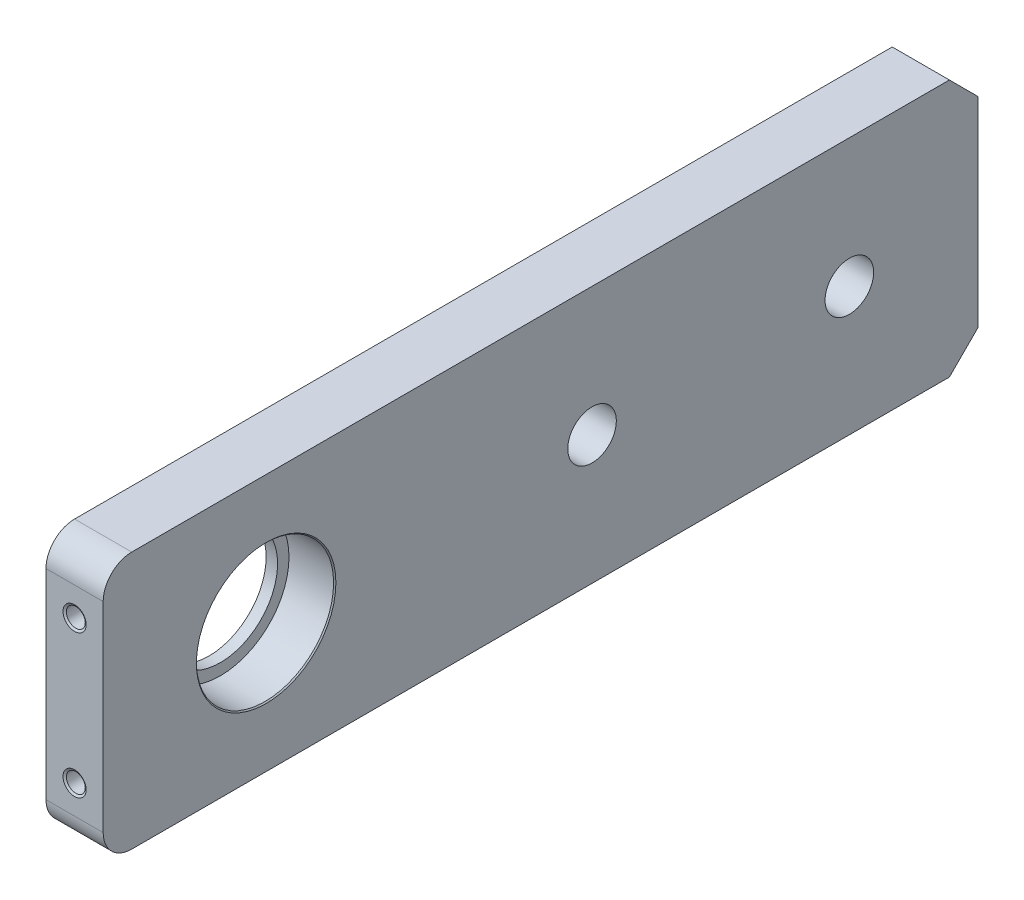
ISO-10303-21;
HEADER;
FILE_DESCRIPTION(('STEP AP214'),'2;1');
FILE_NAME('part.step','',(''),(''),'','','');
FILE_SCHEMA(('AUTOMOTIVE_DESIGN { 1 0 10303 214 1 1 1 1 }'));
ENDSEC;
DATA;
#1=APPLICATION_CONTEXT('core data for automotive mechanical design processes');
#2=APPLICATION_PROTOCOL_DEFINITION('international standard','automotive_design',2000,#1);
#3=PRODUCT_CONTEXT('',#1,'mechanical');
#4=PRODUCT('Part','Part','',(#3));
#5=PRODUCT_RELATED_PRODUCT_CATEGORY('part','',(#4));
#6=PRODUCT_DEFINITION_FORMATION('','',#4);
#7=PRODUCT_DEFINITION_CONTEXT('part definition',#1,'design');
#8=PRODUCT_DEFINITION('design','',#6,#7);
#9=PRODUCT_DEFINITION_SHAPE('','',#8);
#10=(LENGTH_UNIT() NAMED_UNIT(*) SI_UNIT(.MILLI.,.METRE.));
#11=(NAMED_UNIT(*) PLANE_ANGLE_UNIT() SI_UNIT($,.RADIAN.));
#12=(NAMED_UNIT(*) SI_UNIT($,.STERADIAN.) SOLID_ANGLE_UNIT());
#13=UNCERTAINTY_MEASURE_WITH_UNIT(LENGTH_MEASURE(1.E-05),#10,'distance_accuracy_value','');
#14=(GEOMETRIC_REPRESENTATION_CONTEXT(3) GLOBAL_UNCERTAINTY_ASSIGNED_CONTEXT((#13)) GLOBAL_UNIT_ASSIGNED_CONTEXT((#10,
#11,#12)) REPRESENTATION_CONTEXT('',''));
#15=CARTESIAN_POINT('',(0.,0.,0.));
#16=DIRECTION('',(0.,0.,1.));
#17=DIRECTION('',(1.,0.,0.));
#18=AXIS2_PLACEMENT_3D('',#15,#16,#17);
#19=CARTESIAN_POINT('',(5.,0.,0.));
#20=DIRECTION('',(1.,0.,0.));
#21=DIRECTION('',(0.,0.,-1.));
#22=AXIS2_PLACEMENT_3D('',#19,#20,#21);
#23=PLANE('',#22);
#24=CARTESIAN_POINT('',(5.,-22.5,-28.5));
#25=DIRECTION('',(1.,0.,0.));
#26=DIRECTION('',(0.,0.,-1.));
#27=AXIS2_PLACEMENT_3D('',#24,#25,#26);
#28=CIRCLE('',#27,12.2);
#29=CARTESIAN_POINT('',(5.,-22.5,-40.7));
#30=VERTEX_POINT('',#29);
#31=EDGE_CURVE('E75',#30,#30,#28,.F.);
#32=ORIENTED_EDGE('',*,*,#31,.T.);
#33=EDGE_LOOP('',(#32));
#34=FACE_BOUND('',#33,.T.);
#35=CARTESIAN_POINT('',(5.,-22.5,-85.5));
#36=DIRECTION('',(1.,0.,0.));
#37=DIRECTION('',(0.,0.,-1.));
#38=AXIS2_PLACEMENT_3D('',#35,#36,#37);
#39=CIRCLE('',#38,4.25);
#40=CARTESIAN_POINT('',(5.,-22.5,-89.75));
#41=VERTEX_POINT('',#40);
#42=EDGE_CURVE('E271',#41,#41,#39,.T.);
#43=ORIENTED_EDGE('',*,*,#42,.F.);
#44=EDGE_LOOP('',(#43));
#45=FACE_BOUND('',#44,.T.);
#46=DIRECTION('',(0.,0.,1.));
#47=VECTOR('',#46,1.);
#48=CARTESIAN_POINT('',(5.,0.,0.));
#49=LINE('',#48,#47);
#50=CARTESIAN_POINT('',(5.,0.,-148.));
#51=VERTEX_POINT('',#50);
#52=CARTESIAN_POINT('',(5.,0.,-5.));
#53=VERTEX_POINT('',#52);
#54=EDGE_CURVE('E176',#51,#53,#49,.T.);
#55=ORIENTED_EDGE('',*,*,#54,.T.);
#56=CARTESIAN_POINT('',(5.,-5.,-5.));
#57=DIRECTION('',(1.,0.,0.));
#58=DIRECTION('',(0.,0.,-1.));
#59=AXIS2_PLACEMENT_3D('',#56,#57,#58);
#60=CIRCLE('',#59,5.);
#61=CARTESIAN_POINT('',(5.,-5.,0.));
#62=VERTEX_POINT('',#61);
#63=EDGE_CURVE('E198',#53,#62,#60,.T.);
#64=ORIENTED_EDGE('',*,*,#63,.T.);
#65=DIRECTION('',(0.,-1.,0.));
#66=VECTOR('',#65,1.);
#67=CARTESIAN_POINT('',(5.,0.,0.));
#68=LINE('',#67,#66);
#69=CARTESIAN_POINT('',(5.,-40.,0.));
#70=VERTEX_POINT('',#69);
#71=EDGE_CURVE('E165',#62,#70,#68,.T.);
#72=ORIENTED_EDGE('',*,*,#71,.T.);
#73=CARTESIAN_POINT('',(5.,-40.,-5.00000000000001));
#74=DIRECTION('',(1.,0.,0.));
#75=DIRECTION('',(0.,0.,-1.));
#76=AXIS2_PLACEMENT_3D('',#73,#74,#75);
#77=CIRCLE('',#76,5.);
#78=CARTESIAN_POINT('',(5.,-45.,-5.00000000000001));
#79=VERTEX_POINT('',#78);
#80=EDGE_CURVE('E82',#70,#79,#77,.T.);
#81=ORIENTED_EDGE('',*,*,#80,.T.);
#82=DIRECTION('',(0.,0.,-1.));
#83=VECTOR('',#82,1.);
#84=CARTESIAN_POINT('',(5.,-45.,0.));
#85=LINE('',#84,#83);
#86=CARTESIAN_POINT('',(5.,-45.,-148.));
#87=VERTEX_POINT('',#86);
#88=EDGE_CURVE('E262',#79,#87,#85,.T.);
#89=ORIENTED_EDGE('',*,*,#88,.T.);
#90=DIRECTION('',(0.,-0.707106781186547,0.707106781186549));
#91=VECTOR('',#90,1.);
#92=CARTESIAN_POINT('',(5.,-96.5000000000001,-96.4999999999998));
#93=LINE('',#92,#91);
#94=CARTESIAN_POINT('',(5.,-40.,-153.));
#95=VERTEX_POINT('',#94);
#96=EDGE_CURVE('E182',#87,#95,#93,.F.);
#97=ORIENTED_EDGE('',*,*,#96,.T.);
#98=DIRECTION('',(0.,1.,0.));
#99=VECTOR('',#98,1.);
#100=CARTESIAN_POINT('',(5.,0.,-153.));
#101=LINE('',#100,#99);
#102=CARTESIAN_POINT('',(5.,-5.,-153.));
#103=VERTEX_POINT('',#102);
#104=EDGE_CURVE('E155',#95,#103,#101,.T.);
#105=ORIENTED_EDGE('',*,*,#104,.T.);
#106=DIRECTION('',(0.,-0.707106781186551,-0.707106781186544));
#107=VECTOR('',#106,1.);
#108=CARTESIAN_POINT('',(5.,74.,-74.0000000000008));
#109=LINE('',#108,#107);
#110=EDGE_CURVE('E180',#103,#51,#109,.F.);
#111=ORIENTED_EDGE('',*,*,#110,.T.);
#112=EDGE_LOOP('',(#55,#64,#72,#81,#89,#97,#105,#111));
#113=FACE_BOUND('',#112,.T.);
#114=CARTESIAN_POINT('',(5.,-22.5,-130.5));
#115=DIRECTION('',(1.,0.,0.));
#116=DIRECTION('',(0.,0.,-1.));
#117=AXIS2_PLACEMENT_3D('',#114,#115,#116);
#118=CIRCLE('',#117,4.25);
#119=CARTESIAN_POINT('',(5.,-22.5,-134.75));
#120=VERTEX_POINT('',#119);
#121=EDGE_CURVE('E279',#120,#120,#118,.T.);
#122=ORIENTED_EDGE('',*,*,#121,.F.);
#123=EDGE_LOOP('',(#122));
#124=FACE_BOUND('',#123,.T.);
#125=ADVANCED_FACE('F67',(#34,#45,#113,#124),#23,.T.);
#126=CARTESIAN_POINT('',(-5.,0.,0.));
#127=DIRECTION('',(1.,0.,0.));
#128=DIRECTION('',(0.,0.,-1.));
#129=AXIS2_PLACEMENT_3D('',#126,#127,#128);
#130=PLANE('',#129);
#131=DIRECTION('',(0.,-1.,0.));
#132=VECTOR('',#131,1.);
#133=CARTESIAN_POINT('',(-5.,0.,0.));
#134=LINE('',#133,#132);
#135=CARTESIAN_POINT('',(-5.,-5.,0.));
#136=VERTEX_POINT('',#135);
#137=CARTESIAN_POINT('',(-5.,-40.,0.));
#138=VERTEX_POINT('',#137);
#139=EDGE_CURVE('E167',#136,#138,#134,.T.);
#140=ORIENTED_EDGE('',*,*,#139,.F.);
#141=CARTESIAN_POINT('',(-5.,-5.,-5.));
#142=DIRECTION('',(1.,0.,0.));
#143=DIRECTION('',(0.,0.,-1.));
#144=AXIS2_PLACEMENT_3D('',#141,#142,#143);
#145=CIRCLE('',#144,5.);
#146=CARTESIAN_POINT('',(-5.,0.,-5.));
#147=VERTEX_POINT('',#146);
#148=EDGE_CURVE('E194',#136,#147,#145,.F.);
#149=ORIENTED_EDGE('',*,*,#148,.T.);
#150=DIRECTION('',(0.,0.,1.));
#151=VECTOR('',#150,1.);
#152=CARTESIAN_POINT('',(-5.,0.,0.));
#153=LINE('',#152,#151);
#154=CARTESIAN_POINT('',(-5.,0.,-148.));
#155=VERTEX_POINT('',#154);
#156=EDGE_CURVE('E162',#155,#147,#153,.T.);
#157=ORIENTED_EDGE('',*,*,#156,.F.);
#158=DIRECTION('',(0.,0.707106781186551,0.707106781186544));
#159=VECTOR('',#158,1.);
#160=CARTESIAN_POINT('',(-5.,0.,-148.));
#161=LINE('',#160,#159);
#162=CARTESIAN_POINT('',(-5.,-5.,-153.));
#163=VERTEX_POINT('',#162);
#164=EDGE_CURVE('E146',#155,#163,#161,.F.);
#165=ORIENTED_EDGE('',*,*,#164,.T.);
#166=DIRECTION('',(0.,1.,0.));
#167=VECTOR('',#166,1.);
#168=CARTESIAN_POINT('',(-5.,0.,-153.));
#169=LINE('',#168,#167);
#170=CARTESIAN_POINT('',(-5.,-40.,-153.));
#171=VERTEX_POINT('',#170);
#172=EDGE_CURVE('E152',#171,#163,#169,.T.);
#173=ORIENTED_EDGE('',*,*,#172,.F.);
#174=DIRECTION('',(0.,0.707106781186547,-0.707106781186549));
#175=VECTOR('',#174,1.);
#176=CARTESIAN_POINT('',(-5.,-40.,-153.));
#177=LINE('',#176,#175);
#178=CARTESIAN_POINT('',(-5.,-45.,-148.));
#179=VERTEX_POINT('',#178);
#180=EDGE_CURVE('E136',#171,#179,#177,.F.);
#181=ORIENTED_EDGE('',*,*,#180,.T.);
#182=DIRECTION('',(0.,0.,-1.));
#183=VECTOR('',#182,1.);
#184=CARTESIAN_POINT('',(-5.,-45.,0.));
#185=LINE('',#184,#183);
#186=CARTESIAN_POINT('',(-5.,-45.,-5.00000000000001));
#187=VERTEX_POINT('',#186);
#188=EDGE_CURVE('E163',#187,#179,#185,.T.);
#189=ORIENTED_EDGE('',*,*,#188,.F.);
#190=CARTESIAN_POINT('',(-5.,-40.,-5.00000000000001));
#191=DIRECTION('',(1.,0.,0.));
#192=DIRECTION('',(0.,0.,-1.));
#193=AXIS2_PLACEMENT_3D('',#190,#191,#192);
#194=CIRCLE('',#193,5.);
#195=EDGE_CURVE('E192',#187,#138,#194,.F.);
#196=ORIENTED_EDGE('',*,*,#195,.T.);
#197=EDGE_LOOP('',(#140,#149,#157,#165,#173,#181,#189,#196));
#198=FACE_BOUND('',#197,.T.);
#199=CARTESIAN_POINT('',(-5.,-22.5,-28.5));
#200=DIRECTION('',(1.,0.,0.));
#201=DIRECTION('',(0.,0.,-1.));
#202=AXIS2_PLACEMENT_3D('',#199,#200,#201);
#203=CIRCLE('',#202,10.);
#204=CARTESIAN_POINT('',(-5.,-22.5,-38.5));
#205=VERTEX_POINT('',#204);
#206=EDGE_CURVE('E266',#205,#205,#203,.T.);
#207=ORIENTED_EDGE('',*,*,#206,.T.);
#208=EDGE_LOOP('',(#207));
#209=FACE_BOUND('',#208,.T.);
#210=CARTESIAN_POINT('',(-5.,-22.5,-85.5));
#211=DIRECTION('',(1.,0.,0.));
#212=DIRECTION('',(0.,0.,-1.));
#213=AXIS2_PLACEMENT_3D('',#210,#211,#212);
#214=CIRCLE('',#213,4.25);
#215=CARTESIAN_POINT('',(-5.,-22.5,-89.75));
#216=VERTEX_POINT('',#215);
#217=EDGE_CURVE('E274',#216,#216,#214,.T.);
#218=ORIENTED_EDGE('',*,*,#217,.T.);
#219=EDGE_LOOP('',(#218));
#220=FACE_BOUND('',#219,.T.);
#221=CARTESIAN_POINT('',(-5.,-22.5,-130.5));
#222=DIRECTION('',(1.,0.,0.));
#223=DIRECTION('',(0.,0.,-1.));
#224=AXIS2_PLACEMENT_3D('',#221,#222,#223);
#225=CIRCLE('',#224,4.25);
#226=CARTESIAN_POINT('',(-5.,-22.5,-134.75));
#227=VERTEX_POINT('',#226);
#228=EDGE_CURVE('E174',#227,#227,#225,.T.);
#229=ORIENTED_EDGE('',*,*,#228,.T.);
#230=EDGE_LOOP('',(#229));
#231=FACE_BOUND('',#230,.T.);
#232=ADVANCED_FACE('F159',(#198,#209,#220,#231),#130,.F.);
#233=CARTESIAN_POINT('',(5.,0.,0.));
#234=DIRECTION('',(0.,0.,-1.));
#235=DIRECTION('',(0.,1.,0.));
#236=AXIS2_PLACEMENT_3D('',#233,#234,#235);
#237=PLANE('',#236);
#238=CARTESIAN_POINT('',(0.,-9.99999999999999,0.));
#239=DIRECTION('',(0.,0.,1.));
#240=DIRECTION('',(1.,0.,0.));
#241=AXIS2_PLACEMENT_3D('',#238,#239,#240);
#242=CIRCLE('',#241,2.025);
#243=CARTESIAN_POINT('',(2.025,-9.99999999999999,0.));
#244=VERTEX_POINT('',#243);
#245=EDGE_CURVE('E302',#244,#244,#242,.T.);
#246=ORIENTED_EDGE('',*,*,#245,.F.);
#247=EDGE_LOOP('',(#246));
#248=FACE_BOUND('',#247,.T.);
#249=CARTESIAN_POINT('',(0.,-35.,0.));
#250=DIRECTION('',(0.,0.,1.));
#251=DIRECTION('',(1.,0.,0.));
#252=AXIS2_PLACEMENT_3D('',#249,#250,#251);
#253=CIRCLE('',#252,2.025);
#254=CARTESIAN_POINT('',(2.025,-35.,0.));
#255=VERTEX_POINT('',#254);
#256=EDGE_CURVE('E293',#255,#255,#253,.T.);
#257=ORIENTED_EDGE('',*,*,#256,.F.);
#258=EDGE_LOOP('',(#257));
#259=FACE_BOUND('',#258,.T.);
#260=ORIENTED_EDGE('',*,*,#71,.F.);
#261=DIRECTION('',(-1.,0.,0.));
#262=VECTOR('',#261,1.);
#263=CARTESIAN_POINT('',(5.,-5.,0.));
#264=LINE('',#263,#262);
#265=EDGE_CURVE('E189',#62,#136,#264,.T.);
#266=ORIENTED_EDGE('',*,*,#265,.T.);
#267=ORIENTED_EDGE('',*,*,#139,.T.);
#268=DIRECTION('',(-1.,0.,0.));
#269=VECTOR('',#268,1.);
#270=CARTESIAN_POINT('',(5.,-40.,0.));
#271=LINE('',#270,#269);
#272=EDGE_CURVE('E187',#138,#70,#271,.F.);
#273=ORIENTED_EDGE('',*,*,#272,.T.);
#274=EDGE_LOOP('',(#260,#266,#267,#273));
#275=FACE_BOUND('',#274,.T.);
#276=ADVANCED_FACE('F226',(#248,#259,#275),#237,.F.);
#277=CARTESIAN_POINT('',(5.,-45.,0.));
#278=DIRECTION('',(0.,1.,0.));
#279=DIRECTION('',(0.,0.,1.));
#280=AXIS2_PLACEMENT_3D('',#277,#278,#279);
#281=PLANE('',#280);
#282=ORIENTED_EDGE('',*,*,#88,.F.);
#283=DIRECTION('',(-1.,0.,0.));
#284=VECTOR('',#283,1.);
#285=CARTESIAN_POINT('',(5.,-45.,-5.00000000000001));
#286=LINE('',#285,#284);
#287=EDGE_CURVE('E200',#79,#187,#286,.T.);
#288=ORIENTED_EDGE('',*,*,#287,.T.);
#289=ORIENTED_EDGE('',*,*,#188,.T.);
#290=DIRECTION('',(1.,0.,0.));
#291=VECTOR('',#290,1.);
#292=CARTESIAN_POINT('',(5.,-45.,-148.));
#293=LINE('',#292,#291);
#294=EDGE_CURVE('E142',#179,#87,#293,.T.);
#295=ORIENTED_EDGE('',*,*,#294,.T.);
#296=EDGE_LOOP('',(#282,#288,#289,#295));
#297=FACE_BOUND('',#296,.T.);
#298=ADVANCED_FACE('F237',(#297),#281,.F.);
#299=CARTESIAN_POINT('',(5.,0.,-153.));
#300=DIRECTION('',(0.,0.,1.));
#301=DIRECTION('',(1.,0.,0.));
#302=AXIS2_PLACEMENT_3D('',#299,#300,#301);
#303=PLANE('',#302);
#304=ORIENTED_EDGE('',*,*,#104,.F.);
#305=DIRECTION('',(-1.,0.,0.));
#306=VECTOR('',#305,1.);
#307=CARTESIAN_POINT('',(5.,-40.,-153.));
#308=LINE('',#307,#306);
#309=EDGE_CURVE('E140',#95,#171,#308,.T.);
#310=ORIENTED_EDGE('',*,*,#309,.T.);
#311=ORIENTED_EDGE('',*,*,#172,.T.);
#312=DIRECTION('',(1.,0.,0.));
#313=VECTOR('',#312,1.);
#314=CARTESIAN_POINT('',(5.,-5.,-153.));
#315=LINE('',#314,#313);
#316=EDGE_CURVE('E156',#163,#103,#315,.T.);
#317=ORIENTED_EDGE('',*,*,#316,.T.);
#318=EDGE_LOOP('',(#304,#310,#311,#317));
#319=FACE_BOUND('',#318,.T.);
#320=ADVANCED_FACE('F151',(#319),#303,.F.);
#321=CARTESIAN_POINT('',(5.,0.,0.));
#322=DIRECTION('',(0.,-1.,0.));
#323=DIRECTION('',(0.,0.,-1.));
#324=AXIS2_PLACEMENT_3D('',#321,#322,#323);
#325=PLANE('',#324);
#326=ORIENTED_EDGE('',*,*,#156,.T.);
#327=DIRECTION('',(-1.,0.,0.));
#328=VECTOR('',#327,1.);
#329=CARTESIAN_POINT('',(5.,0.,-5.));
#330=LINE('',#329,#328);
#331=EDGE_CURVE('E90',#147,#53,#330,.F.);
#332=ORIENTED_EDGE('',*,*,#331,.T.);
#333=ORIENTED_EDGE('',*,*,#54,.F.);
#334=DIRECTION('',(-1.,0.,0.));
#335=VECTOR('',#334,1.);
#336=CARTESIAN_POINT('',(5.,0.,-148.));
#337=LINE('',#336,#335);
#338=EDGE_CURVE('E184',#51,#155,#337,.T.);
#339=ORIENTED_EDGE('',*,*,#338,.T.);
#340=EDGE_LOOP('',(#326,#332,#333,#339));
#341=FACE_BOUND('',#340,.T.);
#342=ADVANCED_FACE('F232',(#341),#325,.F.);
#343=CARTESIAN_POINT('',(5.,-22.5,-28.5));
#344=DIRECTION('',(-1.,0.,0.));
#345=DIRECTION('',(0.,0.,1.));
#346=AXIS2_PLACEMENT_3D('',#343,#344,#345);
#347=CYLINDRICAL_SURFACE('',#346,10.);
#348=CARTESIAN_POINT('',(-3.,-22.5,-28.5));
#349=DIRECTION('',(-1.,0.,0.));
#350=DIRECTION('',(0.,0.,1.));
#351=AXIS2_PLACEMENT_3D('',#348,#349,#350);
#352=CIRCLE('',#351,10.);
#353=CARTESIAN_POINT('',(-3.,-22.5,-18.5));
#354=VERTEX_POINT('',#353);
#355=EDGE_CURVE('E171',#354,#354,#352,.T.);
#356=ORIENTED_EDGE('',*,*,#355,.F.);
#357=EDGE_LOOP('',(#356));
#358=FACE_BOUND('',#357,.T.);
#359=ORIENTED_EDGE('',*,*,#206,.F.);
#360=EDGE_LOOP('',(#359));
#361=FACE_BOUND('',#360,.T.);
#362=ADVANCED_FACE('F229',(#358,#361),#347,.F.);
#363=CARTESIAN_POINT('',(5.,-22.5,-85.5));
#364=DIRECTION('',(-1.,0.,0.));
#365=DIRECTION('',(0.,0.,1.));
#366=AXIS2_PLACEMENT_3D('',#363,#364,#365);
#367=CYLINDRICAL_SURFACE('',#366,4.25);
#368=ORIENTED_EDGE('',*,*,#42,.T.);
#369=EDGE_LOOP('',(#368));
#370=FACE_BOUND('',#369,.T.);
#371=ORIENTED_EDGE('',*,*,#217,.F.);
#372=EDGE_LOOP('',(#371));
#373=FACE_BOUND('',#372,.T.);
#374=ADVANCED_FACE('F336',(#370,#373),#367,.F.);
#375=CARTESIAN_POINT('',(5.,-22.5,-130.5));
#376=DIRECTION('',(-1.,0.,0.));
#377=DIRECTION('',(0.,0.,1.));
#378=AXIS2_PLACEMENT_3D('',#375,#376,#377);
#379=CYLINDRICAL_SURFACE('',#378,4.25);
#380=ORIENTED_EDGE('',*,*,#121,.T.);
#381=EDGE_LOOP('',(#380));
#382=FACE_BOUND('',#381,.T.);
#383=ORIENTED_EDGE('',*,*,#228,.F.);
#384=EDGE_LOOP('',(#383));
#385=FACE_BOUND('',#384,.T.);
#386=ADVANCED_FACE('F333',(#382,#385),#379,.F.);
#387=CARTESIAN_POINT('',(-3.,-22.5,-28.5));
#388=DIRECTION('',(1.,0.,0.));
#389=DIRECTION('',(0.,0.,-1.));
#390=AXIS2_PLACEMENT_3D('',#387,#388,#389);
#391=CYLINDRICAL_SURFACE('',#390,12.);
#392=CARTESIAN_POINT('',(4.80000000000001,-22.5,-28.5));
#393=DIRECTION('',(1.,0.,0.));
#394=DIRECTION('',(0.,0.,-1.));
#395=AXIS2_PLACEMENT_3D('',#392,#393,#394);
#396=CIRCLE('',#395,12.);
#397=CARTESIAN_POINT('',(4.80000000000001,-22.5,-40.5));
#398=VERTEX_POINT('',#397);
#399=EDGE_CURVE('E12',#398,#398,#396,.T.);
#400=ORIENTED_EDGE('',*,*,#399,.T.);
#401=EDGE_LOOP('',(#400));
#402=FACE_BOUND('',#401,.T.);
#403=CARTESIAN_POINT('',(-3.,-22.5,-28.5));
#404=DIRECTION('',(-1.,0.,0.));
#405=DIRECTION('',(0.,0.,1.));
#406=AXIS2_PLACEMENT_3D('',#403,#404,#405);
#407=CIRCLE('',#406,12.);
#408=CARTESIAN_POINT('',(-3.,-22.5,-16.5));
#409=VERTEX_POINT('',#408);
#410=EDGE_CURVE('E175',#409,#409,#407,.T.);
#411=ORIENTED_EDGE('',*,*,#410,.T.);
#412=EDGE_LOOP('',(#411));
#413=FACE_BOUND('',#412,.T.);
#414=ADVANCED_FACE('F329',(#402,#413),#391,.F.);
#415=CARTESIAN_POINT('',(-3.,-22.5,-28.5));
#416=DIRECTION('',(-1.,0.,0.));
#417=DIRECTION('',(0.,0.,1.));
#418=AXIS2_PLACEMENT_3D('',#415,#416,#417);
#419=PLANE('',#418);
#420=ORIENTED_EDGE('',*,*,#355,.T.);
#421=EDGE_LOOP('',(#420));
#422=FACE_BOUND('',#421,.T.);
#423=ORIENTED_EDGE('',*,*,#410,.F.);
#424=EDGE_LOOP('',(#423));
#425=FACE_BOUND('',#424,.T.);
#426=ADVANCED_FACE('F247',(#422,#425),#419,.F.);
#427=CARTESIAN_POINT('',(5.,-40.,-153.));
#428=DIRECTION('',(0.,0.707106781186548,0.707106781186546));
#429=DIRECTION('',(-1.,0.,0.));
#430=AXIS2_PLACEMENT_3D('',#427,#428,#429);
#431=PLANE('',#430);
#432=ORIENTED_EDGE('',*,*,#96,.F.);
#433=ORIENTED_EDGE('',*,*,#294,.F.);
#434=ORIENTED_EDGE('',*,*,#180,.F.);
#435=ORIENTED_EDGE('',*,*,#309,.F.);
#436=EDGE_LOOP('',(#432,#433,#434,#435));
#437=FACE_BOUND('',#436,.T.);
#438=ADVANCED_FACE('F139',(#437),#431,.F.);
#439=CARTESIAN_POINT('',(5.,0.,-148.));
#440=DIRECTION('',(0.,-0.707106781186544,0.707106781186551));
#441=DIRECTION('',(-1.,0.,0.));
#442=AXIS2_PLACEMENT_3D('',#439,#440,#441);
#443=PLANE('',#442);
#444=ORIENTED_EDGE('',*,*,#110,.F.);
#445=ORIENTED_EDGE('',*,*,#316,.F.);
#446=ORIENTED_EDGE('',*,*,#164,.F.);
#447=ORIENTED_EDGE('',*,*,#338,.F.);
#448=EDGE_LOOP('',(#444,#445,#446,#447));
#449=FACE_BOUND('',#448,.T.);
#450=ADVANCED_FACE('F246',(#449),#443,.F.);
#451=CARTESIAN_POINT('',(5.,-5.,-5.));
#452=DIRECTION('',(-1.,0.,0.));
#453=DIRECTION('',(0.,0.,1.));
#454=AXIS2_PLACEMENT_3D('',#451,#452,#453);
#455=CYLINDRICAL_SURFACE('',#454,5.);
#456=ORIENTED_EDGE('',*,*,#63,.F.);
#457=ORIENTED_EDGE('',*,*,#331,.F.);
#458=ORIENTED_EDGE('',*,*,#148,.F.);
#459=ORIENTED_EDGE('',*,*,#265,.F.);
#460=EDGE_LOOP('',(#456,#457,#458,#459));
#461=FACE_BOUND('',#460,.T.);
#462=ADVANCED_FACE('F218',(#461),#455,.T.);
#463=CARTESIAN_POINT('',(5.,-40.,-5.00000000000001));
#464=DIRECTION('',(-1.,0.,0.));
#465=DIRECTION('',(0.,0.,1.));
#466=AXIS2_PLACEMENT_3D('',#463,#464,#465);
#467=CYLINDRICAL_SURFACE('',#466,5.);
#468=ORIENTED_EDGE('',*,*,#80,.F.);
#469=ORIENTED_EDGE('',*,*,#272,.F.);
#470=ORIENTED_EDGE('',*,*,#195,.F.);
#471=ORIENTED_EDGE('',*,*,#287,.F.);
#472=EDGE_LOOP('',(#468,#469,#470,#471));
#473=FACE_BOUND('',#472,.T.);
#474=ADVANCED_FACE('F209',(#473),#467,.T.);
#475=CARTESIAN_POINT('',(5.,-22.5,-28.5));
#476=DIRECTION('',(1.,0.,0.));
#477=DIRECTION('',(0.,0.,-1.));
#478=AXIS2_PLACEMENT_3D('',#475,#476,#477);
#479=CONICAL_SURFACE('',#478,12.2,0.78539816339747);
#480=ORIENTED_EDGE('',*,*,#399,.F.);
#481=EDGE_LOOP('',(#480));
#482=FACE_BOUND('',#481,.T.);
#483=ORIENTED_EDGE('',*,*,#31,.F.);
#484=EDGE_LOOP('',(#483));
#485=FACE_BOUND('',#484,.T.);
#486=ADVANCED_FACE('F69',(#482,#485),#479,.F.);
#487=CARTESIAN_POINT('',(0.,-35.,-15.5));
#488=DIRECTION('',(0.,0.,-1.));
#489=DIRECTION('',(-1.,0.,0.));
#490=AXIS2_PLACEMENT_3D('',#487,#488,#489);
#491=PLANE('',#490);
#492=CARTESIAN_POINT('',(0.,-35.,-15.5));
#493=DIRECTION('',(0.,0.,1.));
#494=DIRECTION('',(1.,0.,0.));
#495=AXIS2_PLACEMENT_3D('',#492,#493,#494);
#496=CIRCLE('',#495,1.64999999999999);
#497=CARTESIAN_POINT('',(1.64999999999999,-35.,-15.5));
#498=VERTEX_POINT('',#497);
#499=EDGE_CURVE('E287',#498,#498,#496,.T.);
#500=ORIENTED_EDGE('',*,*,#499,.T.);
#501=EDGE_LOOP('',(#500));
#502=FACE_BOUND('',#501,.T.);
#503=ADVANCED_FACE('F208',(#502),#491,.F.);
#504=CARTESIAN_POINT('',(0.,-35.,0.));
#505=DIRECTION('',(0.,0.,1.));
#506=DIRECTION('',(1.,0.,0.));
#507=AXIS2_PLACEMENT_3D('',#504,#505,#506);
#508=CYLINDRICAL_SURFACE('',#507,1.64999999999999);
#509=ORIENTED_EDGE('',*,*,#499,.F.);
#510=EDGE_LOOP('',(#509));
#511=FACE_BOUND('',#510,.T.);
#512=CARTESIAN_POINT('',(0.,-35.,-0.216506350946111));
#513=DIRECTION('',(0.,0.,1.));
#514=DIRECTION('',(1.,0.,0.));
#515=AXIS2_PLACEMENT_3D('',#512,#513,#514);
#516=CIRCLE('',#515,1.64999999999999);
#517=CARTESIAN_POINT('',(1.64999999999999,-35.,-0.216506350946111));
#518=VERTEX_POINT('',#517);
#519=EDGE_CURVE('E290',#518,#518,#516,.T.);
#520=ORIENTED_EDGE('',*,*,#519,.T.);
#521=EDGE_LOOP('',(#520));
#522=FACE_BOUND('',#521,.T.);
#523=ADVANCED_FACE('F215',(#511,#522),#508,.F.);
#524=CARTESIAN_POINT('',(0.,-35.,0.));
#525=DIRECTION('',(0.,0.,1.));
#526=DIRECTION('',(1.,0.,0.));
#527=AXIS2_PLACEMENT_3D('',#524,#525,#526);
#528=CONICAL_SURFACE('',#527,2.025,1.0471975511966);
#529=ORIENTED_EDGE('',*,*,#519,.F.);
#530=EDGE_LOOP('',(#529));
#531=FACE_BOUND('',#530,.T.);
#532=ORIENTED_EDGE('',*,*,#256,.T.);
#533=EDGE_LOOP('',(#532));
#534=FACE_BOUND('',#533,.T.);
#535=ADVANCED_FACE('F310',(#531,#534),#528,.F.);
#536=CARTESIAN_POINT('',(0.,-9.99999999999999,-15.5));
#537=DIRECTION('',(0.,0.,-1.));
#538=DIRECTION('',(-1.,0.,0.));
#539=AXIS2_PLACEMENT_3D('',#536,#537,#538);
#540=PLANE('',#539);
#541=CARTESIAN_POINT('',(0.,-9.99999999999999,-15.5));
#542=DIRECTION('',(0.,0.,1.));
#543=DIRECTION('',(1.,0.,0.));
#544=AXIS2_PLACEMENT_3D('',#541,#542,#543);
#545=CIRCLE('',#544,1.64999999999999);
#546=CARTESIAN_POINT('',(1.64999999999999,-9.99999999999999,-15.5));
#547=VERTEX_POINT('',#546);
#548=EDGE_CURVE('E296',#547,#547,#545,.T.);
#549=ORIENTED_EDGE('',*,*,#548,.T.);
#550=EDGE_LOOP('',(#549));
#551=FACE_BOUND('',#550,.T.);
#552=ADVANCED_FACE('F312',(#551),#540,.F.);
#553=CARTESIAN_POINT('',(0.,-9.99999999999999,0.));
#554=DIRECTION('',(0.,0.,1.));
#555=DIRECTION('',(1.,0.,0.));
#556=AXIS2_PLACEMENT_3D('',#553,#554,#555);
#557=CYLINDRICAL_SURFACE('',#556,1.64999999999999);
#558=ORIENTED_EDGE('',*,*,#548,.F.);
#559=EDGE_LOOP('',(#558));
#560=FACE_BOUND('',#559,.T.);
#561=CARTESIAN_POINT('',(0.,-9.99999999999999,-0.216506350946111));
#562=DIRECTION('',(0.,0.,1.));
#563=DIRECTION('',(1.,0.,0.));
#564=AXIS2_PLACEMENT_3D('',#561,#562,#563);
#565=CIRCLE('',#564,1.64999999999999);
#566=CARTESIAN_POINT('',(1.64999999999999,-9.99999999999999,-0.216506350946111));
#567=VERTEX_POINT('',#566);
#568=EDGE_CURVE('E299',#567,#567,#565,.T.);
#569=ORIENTED_EDGE('',*,*,#568,.T.);
#570=EDGE_LOOP('',(#569));
#571=FACE_BOUND('',#570,.T.);
#572=ADVANCED_FACE('F319',(#560,#571),#557,.F.);
#573=CARTESIAN_POINT('',(0.,-9.99999999999999,0.));
#574=DIRECTION('',(0.,0.,1.));
#575=DIRECTION('',(1.,0.,0.));
#576=AXIS2_PLACEMENT_3D('',#573,#574,#575);
#577=CONICAL_SURFACE('',#576,2.025,1.0471975511966);
#578=ORIENTED_EDGE('',*,*,#568,.F.);
#579=EDGE_LOOP('',(#578));
#580=FACE_BOUND('',#579,.T.);
#581=ORIENTED_EDGE('',*,*,#245,.T.);
#582=EDGE_LOOP('',(#581));
#583=FACE_BOUND('',#582,.T.);
#584=ADVANCED_FACE('F306',(#580,#583),#577,.F.);
#585=CLOSED_SHELL('',(#125,#232,#276,#298,#320,#342,#362,#374,#386,#414,#426,#438,#450,#462,
#474,#486,#503,#523,#535,#552,#572,#584));
#586=MANIFOLD_SOLID_BREP('B2',#585);
#587=ADVANCED_BREP_SHAPE_REPRESENTATION('',(#18,#586),#14);
#588=SHAPE_DEFINITION_REPRESENTATION(#9,#587);
ENDSEC;
END-ISO-10303-21;
